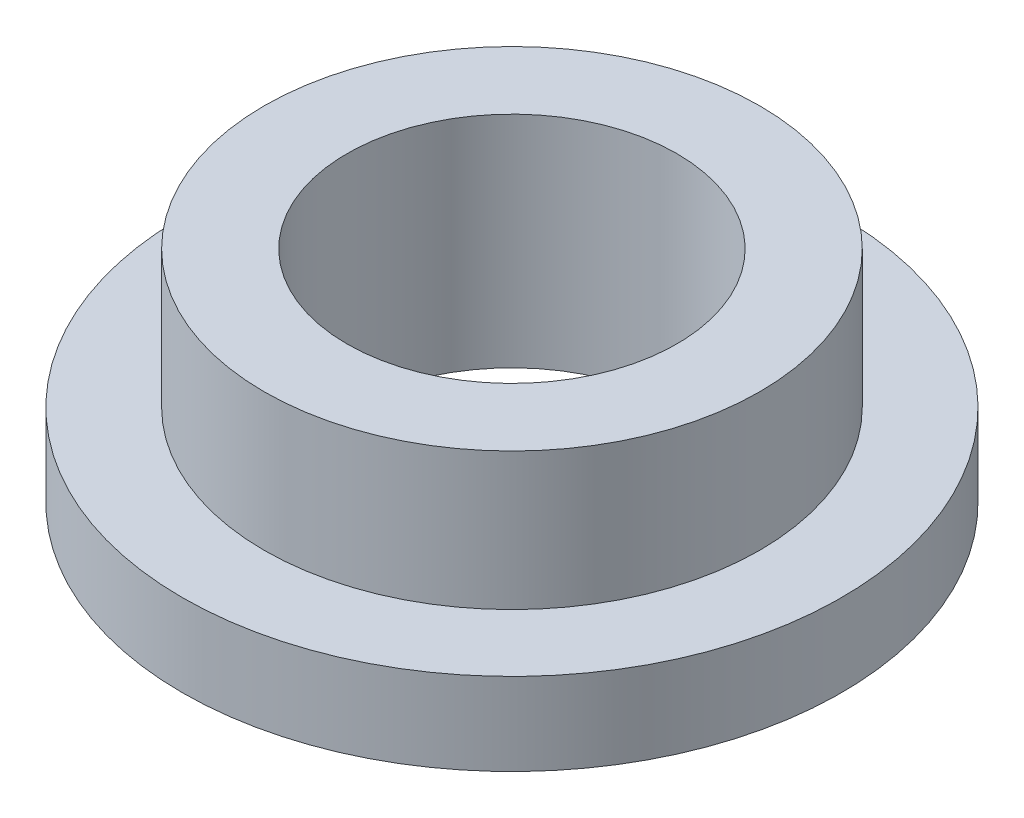
ISO-10303-21;
HEADER;
FILE_DESCRIPTION(('STEP AP214'),'2;1');
FILE_NAME('part.step','',(''),(''),'','','');
FILE_SCHEMA(('AUTOMOTIVE_DESIGN { 1 0 10303 214 1 1 1 1 }'));
ENDSEC;
DATA;
#1=APPLICATION_CONTEXT('core data for automotive mechanical design processes');
#2=APPLICATION_PROTOCOL_DEFINITION('international standard','automotive_design',2000,#1);
#3=PRODUCT_CONTEXT('',#1,'mechanical');
#4=PRODUCT('Part','Part','',(#3));
#5=PRODUCT_RELATED_PRODUCT_CATEGORY('part','',(#4));
#6=PRODUCT_DEFINITION_FORMATION('','',#4);
#7=PRODUCT_DEFINITION_CONTEXT('part definition',#1,'design');
#8=PRODUCT_DEFINITION('design','',#6,#7);
#9=PRODUCT_DEFINITION_SHAPE('','',#8);
#10=(LENGTH_UNIT() NAMED_UNIT(*) SI_UNIT(.MILLI.,.METRE.));
#11=(NAMED_UNIT(*) PLANE_ANGLE_UNIT() SI_UNIT($,.RADIAN.));
#12=(NAMED_UNIT(*) SI_UNIT($,.STERADIAN.) SOLID_ANGLE_UNIT());
#13=UNCERTAINTY_MEASURE_WITH_UNIT(LENGTH_MEASURE(1.E-05),#10,'distance_accuracy_value','');
#14=(GEOMETRIC_REPRESENTATION_CONTEXT(3) GLOBAL_UNCERTAINTY_ASSIGNED_CONTEXT((#13)) GLOBAL_UNIT_ASSIGNED_CONTEXT((#10,
#11,#12)) REPRESENTATION_CONTEXT('',''));
#15=CARTESIAN_POINT('',(0.,0.,0.));
#16=DIRECTION('',(0.,0.,1.));
#17=DIRECTION('',(1.,0.,0.));
#18=AXIS2_PLACEMENT_3D('',#15,#16,#17);
#19=CARTESIAN_POINT('',(0.,8.,0.));
#20=DIRECTION('',(0.,1.,0.));
#21=DIRECTION('',(0.,0.,1.));
#22=AXIS2_PLACEMENT_3D('',#19,#20,#21);
#23=PLANE('',#22);
#24=CARTESIAN_POINT('',(0.,8.,0.));
#25=DIRECTION('',(0.,1.,0.));
#26=DIRECTION('',(0.,0.,1.));
#27=AXIS2_PLACEMENT_3D('',#24,#25,#26);
#28=CIRCLE('',#27,9.02);
#29=CARTESIAN_POINT('',(0.,8.,9.02));
#30=VERTEX_POINT('',#29);
#31=EDGE_CURVE('E10',#30,#30,#28,.T.);
#32=ORIENTED_EDGE('',*,*,#31,.T.);
#33=EDGE_LOOP('',(#32));
#34=FACE_BOUND('',#33,.T.);
#35=CARTESIAN_POINT('',(0.,8.,0.));
#36=DIRECTION('',(0.,1.,0.));
#37=DIRECTION('',(0.,0.,1.));
#38=AXIS2_PLACEMENT_3D('',#35,#36,#37);
#39=CIRCLE('',#38,6.005);
#40=CARTESIAN_POINT('',(0.,8.,6.005));
#41=VERTEX_POINT('',#40);
#42=EDGE_CURVE('E39',#41,#41,#39,.T.);
#43=ORIENTED_EDGE('',*,*,#42,.F.);
#44=EDGE_LOOP('',(#43));
#45=FACE_BOUND('',#44,.T.);
#46=ADVANCED_FACE('F32',(#34,#45),#23,.T.);
#47=CARTESIAN_POINT('',(0.,0.,0.));
#48=DIRECTION('',(0.,1.,0.));
#49=DIRECTION('',(0.,0.,1.));
#50=AXIS2_PLACEMENT_3D('',#47,#48,#49);
#51=PLANE('',#50);
#52=CARTESIAN_POINT('',(0.,0.,0.));
#53=DIRECTION('',(0.,1.,0.));
#54=DIRECTION('',(0.,0.,1.));
#55=AXIS2_PLACEMENT_3D('',#52,#53,#54);
#56=CIRCLE('',#55,6.005);
#57=CARTESIAN_POINT('',(0.,0.,6.005));
#58=VERTEX_POINT('',#57);
#59=EDGE_CURVE('E43',#58,#58,#56,.T.);
#60=ORIENTED_EDGE('',*,*,#59,.T.);
#61=EDGE_LOOP('',(#60));
#62=FACE_BOUND('',#61,.T.);
#63=CARTESIAN_POINT('',(0.,0.,0.));
#64=DIRECTION('',(0.,1.,0.));
#65=DIRECTION('',(0.,0.,1.));
#66=AXIS2_PLACEMENT_3D('',#63,#64,#65);
#67=CIRCLE('',#66,12.);
#68=CARTESIAN_POINT('',(0.,0.,12.));
#69=VERTEX_POINT('',#68);
#70=EDGE_CURVE('E50',#69,#69,#67,.T.);
#71=ORIENTED_EDGE('',*,*,#70,.F.);
#72=EDGE_LOOP('',(#71));
#73=FACE_BOUND('',#72,.T.);
#74=ADVANCED_FACE('F75',(#62,#73),#51,.F.);
#75=CARTESIAN_POINT('',(0.,8.,0.));
#76=DIRECTION('',(0.,-1.,0.));
#77=DIRECTION('',(0.,0.,-1.));
#78=AXIS2_PLACEMENT_3D('',#75,#76,#77);
#79=CYLINDRICAL_SURFACE('',#78,9.02);
#80=CARTESIAN_POINT('',(0.,3.,0.));
#81=DIRECTION('',(0.,1.,0.));
#82=DIRECTION('',(0.,0.,1.));
#83=AXIS2_PLACEMENT_3D('',#80,#81,#82);
#84=CIRCLE('',#83,9.02);
#85=CARTESIAN_POINT('',(0.,3.,9.02));
#86=VERTEX_POINT('',#85);
#87=EDGE_CURVE('E53',#86,#86,#84,.T.);
#88=ORIENTED_EDGE('',*,*,#87,.T.);
#89=EDGE_LOOP('',(#88));
#90=FACE_BOUND('',#89,.T.);
#91=ORIENTED_EDGE('',*,*,#31,.F.);
#92=EDGE_LOOP('',(#91));
#93=FACE_BOUND('',#92,.T.);
#94=ADVANCED_FACE('F34',(#90,#93),#79,.T.);
#95=CARTESIAN_POINT('',(0.,8.,0.));
#96=DIRECTION('',(0.,-1.,0.));
#97=DIRECTION('',(0.,0.,-1.));
#98=AXIS2_PLACEMENT_3D('',#95,#96,#97);
#99=CYLINDRICAL_SURFACE('',#98,6.005);
#100=ORIENTED_EDGE('',*,*,#42,.T.);
#101=EDGE_LOOP('',(#100));
#102=FACE_BOUND('',#101,.T.);
#103=ORIENTED_EDGE('',*,*,#59,.F.);
#104=EDGE_LOOP('',(#103));
#105=FACE_BOUND('',#104,.T.);
#106=ADVANCED_FACE('F64',(#102,#105),#99,.F.);
#107=CARTESIAN_POINT('',(0.,3.,0.));
#108=DIRECTION('',(0.,1.,0.));
#109=DIRECTION('',(0.,0.,1.));
#110=AXIS2_PLACEMENT_3D('',#107,#108,#109);
#111=PLANE('',#110);
#112=CARTESIAN_POINT('',(0.,3.,0.));
#113=DIRECTION('',(0.,1.,0.));
#114=DIRECTION('',(0.,0.,1.));
#115=AXIS2_PLACEMENT_3D('',#112,#113,#114);
#116=CIRCLE('',#115,12.);
#117=CARTESIAN_POINT('',(0.,3.,12.));
#118=VERTEX_POINT('',#117);
#119=EDGE_CURVE('E48',#118,#118,#116,.T.);
#120=ORIENTED_EDGE('',*,*,#119,.T.);
#121=EDGE_LOOP('',(#120));
#122=FACE_BOUND('',#121,.T.);
#123=ORIENTED_EDGE('',*,*,#87,.F.);
#124=EDGE_LOOP('',(#123));
#125=FACE_BOUND('',#124,.T.);
#126=ADVANCED_FACE('F61',(#122,#125),#111,.T.);
#127=CARTESIAN_POINT('',(0.,3.,0.));
#128=DIRECTION('',(0.,-1.,0.));
#129=DIRECTION('',(0.,0.,-1.));
#130=AXIS2_PLACEMENT_3D('',#127,#128,#129);
#131=CYLINDRICAL_SURFACE('',#130,12.);
#132=ORIENTED_EDGE('',*,*,#119,.F.);
#133=EDGE_LOOP('',(#132));
#134=FACE_BOUND('',#133,.T.);
#135=ORIENTED_EDGE('',*,*,#70,.T.);
#136=EDGE_LOOP('',(#135));
#137=FACE_BOUND('',#136,.T.);
#138=ADVANCED_FACE('F63',(#134,#137),#131,.T.);
#139=CLOSED_SHELL('',(#46,#74,#94,#106,#126,#138));
#140=MANIFOLD_SOLID_BREP('B2',#139);
#141=ADVANCED_BREP_SHAPE_REPRESENTATION('',(#18,#140),#14);
#142=SHAPE_DEFINITION_REPRESENTATION(#9,#141);
ENDSEC;
END-ISO-10303-21;
